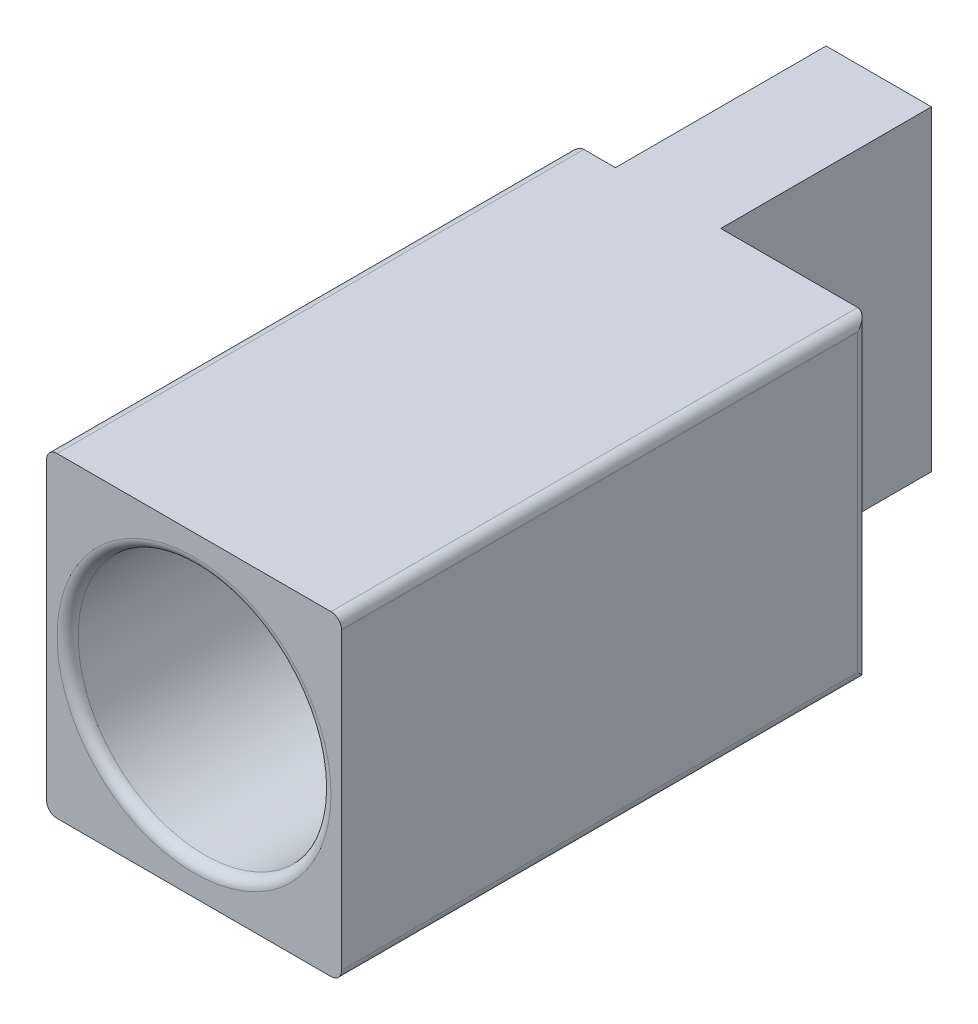
ISO-10303-21;
HEADER;
FILE_DESCRIPTION(('STEP AP214'),'2;1');
FILE_NAME('part.step','',(''),(''),'','','');
FILE_SCHEMA(('AUTOMOTIVE_DESIGN { 1 0 10303 214 1 1 1 1 }'));
ENDSEC;
DATA;
#1=APPLICATION_CONTEXT('core data for automotive mechanical design processes');
#2=APPLICATION_PROTOCOL_DEFINITION('international standard','automotive_design',2000,#1);
#3=PRODUCT_CONTEXT('',#1,'mechanical');
#4=PRODUCT('Part','Part','',(#3));
#5=PRODUCT_RELATED_PRODUCT_CATEGORY('part','',(#4));
#6=PRODUCT_DEFINITION_FORMATION('','',#4);
#7=PRODUCT_DEFINITION_CONTEXT('part definition',#1,'design');
#8=PRODUCT_DEFINITION('design','',#6,#7);
#9=PRODUCT_DEFINITION_SHAPE('','',#8);
#10=(LENGTH_UNIT() NAMED_UNIT(*) SI_UNIT(.MILLI.,.METRE.));
#11=(NAMED_UNIT(*) PLANE_ANGLE_UNIT() SI_UNIT($,.RADIAN.));
#12=(NAMED_UNIT(*) SI_UNIT($,.STERADIAN.) SOLID_ANGLE_UNIT());
#13=UNCERTAINTY_MEASURE_WITH_UNIT(LENGTH_MEASURE(1.E-05),#10,'distance_accuracy_value','');
#14=(GEOMETRIC_REPRESENTATION_CONTEXT(3) GLOBAL_UNCERTAINTY_ASSIGNED_CONTEXT((#13)) GLOBAL_UNIT_ASSIGNED_CONTEXT((#10,
#11,#12)) REPRESENTATION_CONTEXT('',''));
#15=CARTESIAN_POINT('',(0.,0.,0.));
#16=DIRECTION('',(0.,0.,1.));
#17=DIRECTION('',(1.,0.,0.));
#18=AXIS2_PLACEMENT_3D('',#15,#16,#17);
#19=CARTESIAN_POINT('',(2.,-7.5,5.));
#20=DIRECTION('',(-1.,0.,0.));
#21=DIRECTION('',(0.,0.,1.));
#22=AXIS2_PLACEMENT_3D('',#19,#20,#21);
#23=CYLINDRICAL_SURFACE('',#22,1.64999999999999);
#24=CARTESIAN_POINT('',(7.,-7.5,5.));
#25=DIRECTION('',(1.,0.,0.));
#26=DIRECTION('',(0.,0.,-1.));
#27=AXIS2_PLACEMENT_3D('',#24,#25,#26);
#28=CIRCLE('',#27,1.64999999999999);
#29=CARTESIAN_POINT('',(7.,-7.5,3.35000000000001));
#30=VERTEX_POINT('',#29);
#31=EDGE_CURVE('E173',#30,#30,#28,.T.);
#32=ORIENTED_EDGE('',*,*,#31,.T.);
#33=EDGE_LOOP('',(#32));
#34=FACE_BOUND('',#33,.T.);
#35=CARTESIAN_POINT('',(3.,-7.5,5.));
#36=DIRECTION('',(-1.,0.,0.));
#37=DIRECTION('',(0.,0.,1.));
#38=AXIS2_PLACEMENT_3D('',#35,#36,#37);
#39=CIRCLE('',#38,1.64999999999999);
#40=CARTESIAN_POINT('',(3.,-7.5,6.64999999999999));
#41=VERTEX_POINT('',#40);
#42=EDGE_CURVE('E169',#41,#41,#39,.F.);
#43=ORIENTED_EDGE('',*,*,#42,.F.);
#44=EDGE_LOOP('',(#43));
#45=FACE_BOUND('',#44,.T.);
#46=ADVANCED_FACE('F39',(#34,#45),#23,.F.);
#47=CARTESIAN_POINT('',(2.,0.000999999999999265,0.));
#48=DIRECTION('',(1.,0.,0.));
#49=DIRECTION('',(0.,0.,-1.));
#50=AXIS2_PLACEMENT_3D('',#47,#48,#49);
#51=PLANE('',#50);
#52=CARTESIAN_POINT('',(2.,-7.5,5.));
#53=DIRECTION('',(-1.,0.,0.));
#54=DIRECTION('',(0.,0.,1.));
#55=AXIS2_PLACEMENT_3D('',#52,#53,#54);
#56=CIRCLE('',#55,4.);
#57=CARTESIAN_POINT('',(2.,-7.5,9.));
#58=VERTEX_POINT('',#57);
#59=EDGE_CURVE('E242',#58,#58,#56,.T.);
#60=ORIENTED_EDGE('',*,*,#59,.F.);
#61=EDGE_LOOP('',(#60));
#62=FACE_BOUND('',#61,.T.);
#63=DIRECTION('',(0.,0.,-1.));
#64=VECTOR('',#63,1.);
#65=CARTESIAN_POINT('',(2.,0.,0.));
#66=LINE('',#65,#64);
#67=CARTESIAN_POINT('',(2.,0.,10.));
#68=VERTEX_POINT('',#67);
#69=CARTESIAN_POINT('',(2.,0.,0.));
#70=VERTEX_POINT('',#69);
#71=EDGE_CURVE('E137',#68,#70,#66,.T.);
#72=ORIENTED_EDGE('',*,*,#71,.T.);
#73=DIRECTION('',(0.,-1.,0.));
#74=VECTOR('',#73,1.);
#75=CARTESIAN_POINT('',(2.,0.000999999999999265,0.));
#76=LINE('',#75,#74);
#77=CARTESIAN_POINT('',(2.,-15.,0.));
#78=VERTEX_POINT('',#77);
#79=EDGE_CURVE('E132',#70,#78,#76,.T.);
#80=ORIENTED_EDGE('',*,*,#79,.T.);
#81=DIRECTION('',(0.,0.,1.));
#82=VECTOR('',#81,1.);
#83=CARTESIAN_POINT('',(2.,-15.,0.));
#84=LINE('',#83,#82);
#85=CARTESIAN_POINT('',(2.,-15.,10.));
#86=VERTEX_POINT('',#85);
#87=EDGE_CURVE('E135',#78,#86,#84,.T.);
#88=ORIENTED_EDGE('',*,*,#87,.T.);
#89=DIRECTION('',(0.,-1.,0.));
#90=VECTOR('',#89,1.);
#91=CARTESIAN_POINT('',(2.,0.000999999999999265,10.));
#92=LINE('',#91,#90);
#93=EDGE_CURVE('E143',#68,#86,#92,.T.);
#94=ORIENTED_EDGE('',*,*,#93,.F.);
#95=EDGE_LOOP('',(#72,#80,#88,#94));
#96=FACE_BOUND('',#95,.T.);
#97=ADVANCED_FACE('F134',(#62,#96),#51,.F.);
#98=CARTESIAN_POINT('',(0.,0.,35.));
#99=DIRECTION('',(1.,0.,0.));
#100=DIRECTION('',(0.,1.,0.));
#101=AXIS2_PLACEMENT_3D('',#98,#99,#100);
#102=PLANE('',#101);
#103=DIRECTION('',(0.,-1.,0.));
#104=VECTOR('',#103,1.);
#105=CARTESIAN_POINT('',(0.,0.,35.));
#106=LINE('',#105,#104);
#107=CARTESIAN_POINT('',(0.,-0.5,35.));
#108=VERTEX_POINT('',#107);
#109=CARTESIAN_POINT('',(0.,-14.5,35.));
#110=VERTEX_POINT('',#109);
#111=EDGE_CURVE('E162',#108,#110,#106,.T.);
#112=ORIENTED_EDGE('',*,*,#111,.F.);
#113=DIRECTION('',(0.,0.,-1.));
#114=VECTOR('',#113,1.);
#115=CARTESIAN_POINT('',(0.,-0.5,35.));
#116=LINE('',#115,#114);
#117=CARTESIAN_POINT('',(0.,-0.5,10.5));
#118=VERTEX_POINT('',#117);
#119=EDGE_CURVE('E181',#108,#118,#116,.T.);
#120=ORIENTED_EDGE('',*,*,#119,.T.);
#121=DIRECTION('',(0.,-1.,0.));
#122=VECTOR('',#121,1.);
#123=CARTESIAN_POINT('',(0.,-15.,10.5));
#124=LINE('',#123,#122);
#125=CARTESIAN_POINT('',(0.,-14.5,10.5));
#126=VERTEX_POINT('',#125);
#127=EDGE_CURVE('E175',#118,#126,#124,.T.);
#128=ORIENTED_EDGE('',*,*,#127,.T.);
#129=DIRECTION('',(0.,0.,-1.));
#130=VECTOR('',#129,1.);
#131=CARTESIAN_POINT('',(0.,-14.5,35.));
#132=LINE('',#131,#130);
#133=EDGE_CURVE('E178',#126,#110,#132,.F.);
#134=ORIENTED_EDGE('',*,*,#133,.T.);
#135=EDGE_LOOP('',(#112,#120,#128,#134));
#136=FACE_BOUND('',#135,.T.);
#137=ADVANCED_FACE('F322',(#136),#102,.F.);
#138=CARTESIAN_POINT('',(0.,-15.,35.));
#139=DIRECTION('',(0.,1.,0.));
#140=DIRECTION('',(0.,0.,1.));
#141=AXIS2_PLACEMENT_3D('',#138,#139,#140);
#142=PLANE('',#141);
#143=DIRECTION('',(1.,0.,0.));
#144=VECTOR('',#143,1.);
#145=CARTESIAN_POINT('',(0.,-15.,10.));
#146=LINE('',#145,#144);
#147=CARTESIAN_POINT('',(7.,-15.,10.));
#148=VERTEX_POINT('',#147);
#149=CARTESIAN_POINT('',(13.5,-15.,10.));
#150=VERTEX_POINT('',#149);
#151=EDGE_CURVE('E262',#148,#150,#146,.T.);
#152=ORIENTED_EDGE('',*,*,#151,.T.);
#153=DIRECTION('',(0.,0.,-1.));
#154=VECTOR('',#153,1.);
#155=CARTESIAN_POINT('',(13.5,-15.,35.));
#156=LINE('',#155,#154);
#157=CARTESIAN_POINT('',(13.5,-15.,35.));
#158=VERTEX_POINT('',#157);
#159=EDGE_CURVE('E219',#150,#158,#156,.F.);
#160=ORIENTED_EDGE('',*,*,#159,.T.);
#161=DIRECTION('',(1.,0.,0.));
#162=VECTOR('',#161,1.);
#163=CARTESIAN_POINT('',(0.,-15.,35.));
#164=LINE('',#163,#162);
#165=CARTESIAN_POINT('',(0.500000000000002,-15.,35.));
#166=VERTEX_POINT('',#165);
#167=EDGE_CURVE('E261',#166,#158,#164,.T.);
#168=ORIENTED_EDGE('',*,*,#167,.F.);
#169=DIRECTION('',(0.,0.,-1.));
#170=VECTOR('',#169,1.);
#171=CARTESIAN_POINT('',(0.500000000000002,-15.,35.));
#172=LINE('',#171,#170);
#173=CARTESIAN_POINT('',(0.500000000000002,-15.,10.));
#174=VERTEX_POINT('',#173);
#175=EDGE_CURVE('E64',#166,#174,#172,.T.);
#176=ORIENTED_EDGE('',*,*,#175,.T.);
#177=DIRECTION('',(1.,0.,0.));
#178=VECTOR('',#177,1.);
#179=CARTESIAN_POINT('',(0.,-15.,10.));
#180=LINE('',#179,#178);
#181=EDGE_CURVE('E144',#174,#86,#180,.T.);
#182=ORIENTED_EDGE('',*,*,#181,.T.);
#183=ORIENTED_EDGE('',*,*,#87,.F.);
#184=DIRECTION('',(1.,0.,0.));
#185=VECTOR('',#184,1.);
#186=CARTESIAN_POINT('',(0.,-15.,0.));
#187=LINE('',#186,#185);
#188=CARTESIAN_POINT('',(7.,-15.,0.));
#189=VERTEX_POINT('',#188);
#190=EDGE_CURVE('E149',#78,#189,#187,.T.);
#191=ORIENTED_EDGE('',*,*,#190,.T.);
#192=DIRECTION('',(0.,0.,1.));
#193=VECTOR('',#192,1.);
#194=CARTESIAN_POINT('',(7.,-15.,0.));
#195=LINE('',#194,#193);
#196=EDGE_CURVE('E284',#189,#148,#195,.T.);
#197=ORIENTED_EDGE('',*,*,#196,.T.);
#198=EDGE_LOOP('',(#152,#160,#168,#176,#182,#183,#191,#197));
#199=FACE_BOUND('',#198,.T.);
#200=ADVANCED_FACE('F147',(#199),#142,.F.);
#201=CARTESIAN_POINT('',(14.,0.,35.));
#202=DIRECTION('',(-1.,0.,0.));
#203=DIRECTION('',(0.,-1.,0.));
#204=AXIS2_PLACEMENT_3D('',#201,#202,#203);
#205=PLANE('',#204);
#206=DIRECTION('',(0.,-1.,0.));
#207=VECTOR('',#206,1.);
#208=CARTESIAN_POINT('',(14.,0.,10.5));
#209=LINE('',#208,#207);
#210=CARTESIAN_POINT('',(14.,-14.5,10.5));
#211=VERTEX_POINT('',#210);
#212=CARTESIAN_POINT('',(14.,-0.5,10.5));
#213=VERTEX_POINT('',#212);
#214=EDGE_CURVE('E208',#211,#213,#209,.F.);
#215=ORIENTED_EDGE('',*,*,#214,.T.);
#216=DIRECTION('',(0.,0.,-1.));
#217=VECTOR('',#216,1.);
#218=CARTESIAN_POINT('',(14.,-0.5,35.));
#219=LINE('',#218,#217);
#220=CARTESIAN_POINT('',(14.,-0.5,35.));
#221=VERTEX_POINT('',#220);
#222=EDGE_CURVE('E214',#213,#221,#219,.F.);
#223=ORIENTED_EDGE('',*,*,#222,.T.);
#224=DIRECTION('',(0.,1.,0.));
#225=VECTOR('',#224,1.);
#226=CARTESIAN_POINT('',(14.,0.,35.));
#227=LINE('',#226,#225);
#228=CARTESIAN_POINT('',(14.,-14.5,35.));
#229=VERTEX_POINT('',#228);
#230=EDGE_CURVE('E271',#229,#221,#227,.T.);
#231=ORIENTED_EDGE('',*,*,#230,.F.);
#232=DIRECTION('',(0.,0.,-1.));
#233=VECTOR('',#232,1.);
#234=CARTESIAN_POINT('',(14.,-14.5,35.));
#235=LINE('',#234,#233);
#236=EDGE_CURVE('E211',#229,#211,#235,.T.);
#237=ORIENTED_EDGE('',*,*,#236,.T.);
#238=EDGE_LOOP('',(#215,#223,#231,#237));
#239=FACE_BOUND('',#238,.T.);
#240=ADVANCED_FACE('F358',(#239),#205,.F.);
#241=CARTESIAN_POINT('',(0.,0.,35.));
#242=DIRECTION('',(0.,-1.,0.));
#243=DIRECTION('',(0.,0.,-1.));
#244=AXIS2_PLACEMENT_3D('',#241,#242,#243);
#245=PLANE('',#244);
#246=DIRECTION('',(-1.,0.,0.));
#247=VECTOR('',#246,1.);
#248=CARTESIAN_POINT('',(0.,0.,10.));
#249=LINE('',#248,#247);
#250=CARTESIAN_POINT('',(0.5,0.,10.));
#251=VERTEX_POINT('',#250);
#252=EDGE_CURVE('E152',#68,#251,#249,.T.);
#253=ORIENTED_EDGE('',*,*,#252,.T.);
#254=DIRECTION('',(0.,0.,-1.));
#255=VECTOR('',#254,1.);
#256=CARTESIAN_POINT('',(0.5,0.,35.));
#257=LINE('',#256,#255);
#258=CARTESIAN_POINT('',(0.5,0.,35.));
#259=VERTEX_POINT('',#258);
#260=EDGE_CURVE('E189',#251,#259,#257,.F.);
#261=ORIENTED_EDGE('',*,*,#260,.T.);
#262=DIRECTION('',(-1.,0.,0.));
#263=VECTOR('',#262,1.);
#264=CARTESIAN_POINT('',(0.,0.,35.));
#265=LINE('',#264,#263);
#266=CARTESIAN_POINT('',(13.5,0.,35.));
#267=VERTEX_POINT('',#266);
#268=EDGE_CURVE('E166',#267,#259,#265,.T.);
#269=ORIENTED_EDGE('',*,*,#268,.F.);
#270=DIRECTION('',(0.,0.,-1.));
#271=VECTOR('',#270,1.);
#272=CARTESIAN_POINT('',(13.5,0.,35.));
#273=LINE('',#272,#271);
#274=CARTESIAN_POINT('',(13.5,0.,10.));
#275=VERTEX_POINT('',#274);
#276=EDGE_CURVE('E185',#267,#275,#273,.T.);
#277=ORIENTED_EDGE('',*,*,#276,.T.);
#278=DIRECTION('',(-1.,0.,0.));
#279=VECTOR('',#278,1.);
#280=CARTESIAN_POINT('',(0.,0.,10.));
#281=LINE('',#280,#279);
#282=CARTESIAN_POINT('',(7.,0.,10.));
#283=VERTEX_POINT('',#282);
#284=EDGE_CURVE('E291',#275,#283,#281,.T.);
#285=ORIENTED_EDGE('',*,*,#284,.T.);
#286=DIRECTION('',(0.,0.,-1.));
#287=VECTOR('',#286,1.);
#288=CARTESIAN_POINT('',(7.,0.,0.));
#289=LINE('',#288,#287);
#290=CARTESIAN_POINT('',(7.,0.,0.));
#291=VERTEX_POINT('',#290);
#292=EDGE_CURVE('E277',#283,#291,#289,.T.);
#293=ORIENTED_EDGE('',*,*,#292,.T.);
#294=DIRECTION('',(-1.,0.,0.));
#295=VECTOR('',#294,1.);
#296=CARTESIAN_POINT('',(0.,0.,0.));
#297=LINE('',#296,#295);
#298=EDGE_CURVE('E158',#291,#70,#297,.T.);
#299=ORIENTED_EDGE('',*,*,#298,.T.);
#300=ORIENTED_EDGE('',*,*,#71,.F.);
#301=EDGE_LOOP('',(#253,#261,#269,#277,#285,#293,#299,#300));
#302=FACE_BOUND('',#301,.T.);
#303=ADVANCED_FACE('F355',(#302),#245,.F.);
#304=CARTESIAN_POINT('',(0.,0.,0.));
#305=DIRECTION('',(0.,0.,1.));
#306=DIRECTION('',(1.,0.,0.));
#307=AXIS2_PLACEMENT_3D('',#304,#305,#306);
#308=PLANE('',#307);
#309=ORIENTED_EDGE('',*,*,#190,.F.);
#310=ORIENTED_EDGE('',*,*,#79,.F.);
#311=ORIENTED_EDGE('',*,*,#298,.F.);
#312=DIRECTION('',(0.,-1.,0.));
#313=VECTOR('',#312,1.);
#314=CARTESIAN_POINT('',(7.,0.000999999999999265,0.));
#315=LINE('',#314,#313);
#316=EDGE_CURVE('E156',#291,#189,#315,.T.);
#317=ORIENTED_EDGE('',*,*,#316,.T.);
#318=EDGE_LOOP('',(#309,#310,#311,#317));
#319=FACE_BOUND('',#318,.T.);
#320=ADVANCED_FACE('F155',(#319),#308,.F.);
#321=CARTESIAN_POINT('',(0.,0.,35.));
#322=DIRECTION('',(0.,0.,1.));
#323=DIRECTION('',(1.,0.,0.));
#324=AXIS2_PLACEMENT_3D('',#321,#322,#323);
#325=PLANE('',#324);
#326=CARTESIAN_POINT('',(7.,-7.5,35.));
#327=DIRECTION('',(0.,0.,1.));
#328=DIRECTION('',(1.,0.,0.));
#329=AXIS2_PLACEMENT_3D('',#326,#327,#328);
#330=CIRCLE('',#329,6.5);
#331=CARTESIAN_POINT('',(13.5,-7.5,35.));
#332=VERTEX_POINT('',#331);
#333=EDGE_CURVE('E192',#332,#332,#330,.F.);
#334=ORIENTED_EDGE('',*,*,#333,.T.);
#335=EDGE_LOOP('',(#334));
#336=FACE_BOUND('',#335,.T.);
#337=ORIENTED_EDGE('',*,*,#268,.T.);
#338=CARTESIAN_POINT('',(0.5,-0.5,35.));
#339=DIRECTION('',(0.,0.,1.));
#340=DIRECTION('',(1.,0.,0.));
#341=AXIS2_PLACEMENT_3D('',#338,#339,#340);
#342=CIRCLE('',#341,0.5);
#343=EDGE_CURVE('E205',#259,#108,#342,.T.);
#344=ORIENTED_EDGE('',*,*,#343,.T.);
#345=ORIENTED_EDGE('',*,*,#111,.T.);
#346=CARTESIAN_POINT('',(0.500000000000002,-14.5,35.));
#347=DIRECTION('',(0.,0.,1.));
#348=DIRECTION('',(1.,0.,0.));
#349=AXIS2_PLACEMENT_3D('',#346,#347,#348);
#350=CIRCLE('',#349,0.5);
#351=EDGE_CURVE('E196',#110,#166,#350,.T.);
#352=ORIENTED_EDGE('',*,*,#351,.T.);
#353=ORIENTED_EDGE('',*,*,#167,.T.);
#354=CARTESIAN_POINT('',(13.5,-14.5,35.));
#355=DIRECTION('',(0.,0.,1.));
#356=DIRECTION('',(1.,0.,0.));
#357=AXIS2_PLACEMENT_3D('',#354,#355,#356);
#358=CIRCLE('',#357,0.5);
#359=EDGE_CURVE('E199',#158,#229,#358,.T.);
#360=ORIENTED_EDGE('',*,*,#359,.T.);
#361=ORIENTED_EDGE('',*,*,#230,.T.);
#362=CARTESIAN_POINT('',(13.5,-0.5,35.));
#363=DIRECTION('',(0.,0.,1.));
#364=DIRECTION('',(1.,0.,0.));
#365=AXIS2_PLACEMENT_3D('',#362,#363,#364);
#366=CIRCLE('',#365,0.5);
#367=EDGE_CURVE('E202',#221,#267,#366,.T.);
#368=ORIENTED_EDGE('',*,*,#367,.T.);
#369=EDGE_LOOP('',(#337,#344,#345,#352,#353,#360,#361,#368));
#370=FACE_BOUND('',#369,.T.);
#371=ADVANCED_FACE('F265',(#336,#370),#325,.T.);
#372=CARTESIAN_POINT('',(7.,-7.5,20.));
#373=DIRECTION('',(0.,0.,1.));
#374=DIRECTION('',(1.,0.,0.));
#375=AXIS2_PLACEMENT_3D('',#372,#373,#374);
#376=CYLINDRICAL_SURFACE('',#375,6.);
#377=CARTESIAN_POINT('',(7.,-7.5,20.5));
#378=DIRECTION('',(0.,0.,1.));
#379=DIRECTION('',(1.,0.,0.));
#380=AXIS2_PLACEMENT_3D('',#377,#378,#379);
#381=CIRCLE('',#380,6.);
#382=CARTESIAN_POINT('',(13.,-7.5,20.5));
#383=VERTEX_POINT('',#382);
#384=EDGE_CURVE('E230',#383,#383,#381,.F.);
#385=ORIENTED_EDGE('',*,*,#384,.T.);
#386=EDGE_LOOP('',(#385));
#387=FACE_BOUND('',#386,.T.);
#388=CARTESIAN_POINT('',(7.,-7.5,34.5));
#389=DIRECTION('',(0.,0.,1.));
#390=DIRECTION('',(1.,0.,0.));
#391=AXIS2_PLACEMENT_3D('',#388,#389,#390);
#392=CIRCLE('',#391,6.);
#393=CARTESIAN_POINT('',(13.,-7.5,34.5));
#394=VERTEX_POINT('',#393);
#395=EDGE_CURVE('E226',#394,#394,#392,.T.);
#396=ORIENTED_EDGE('',*,*,#395,.T.);
#397=EDGE_LOOP('',(#396));
#398=FACE_BOUND('',#397,.T.);
#399=ADVANCED_FACE('F345',(#387,#398),#376,.F.);
#400=CARTESIAN_POINT('',(7.,-7.5,20.));
#401=DIRECTION('',(0.,0.,1.));
#402=DIRECTION('',(1.,0.,0.));
#403=AXIS2_PLACEMENT_3D('',#400,#401,#402);
#404=PLANE('',#403);
#405=CARTESIAN_POINT('',(7.,-7.5,20.));
#406=DIRECTION('',(0.,0.,1.));
#407=DIRECTION('',(1.,0.,0.));
#408=AXIS2_PLACEMENT_3D('',#405,#406,#407);
#409=CIRCLE('',#408,5.5);
#410=CARTESIAN_POINT('',(12.5,-7.5,20.));
#411=VERTEX_POINT('',#410);
#412=EDGE_CURVE('E222',#411,#411,#409,.T.);
#413=ORIENTED_EDGE('',*,*,#412,.T.);
#414=EDGE_LOOP('',(#413));
#415=FACE_BOUND('',#414,.T.);
#416=ADVANCED_FACE('F342',(#415),#404,.T.);
#417=CARTESIAN_POINT('',(0.,0.000999999999999265,10.));
#418=DIRECTION('',(0.,0.,-1.));
#419=DIRECTION('',(-1.,0.,0.));
#420=AXIS2_PLACEMENT_3D('',#417,#418,#419);
#421=PLANE('',#420);
#422=ORIENTED_EDGE('',*,*,#284,.F.);
#423=DIRECTION('',(0.,-1.,0.));
#424=VECTOR('',#423,1.);
#425=CARTESIAN_POINT('',(13.5,-15.,10.));
#426=LINE('',#425,#424);
#427=EDGE_CURVE('E49',#275,#150,#426,.T.);
#428=ORIENTED_EDGE('',*,*,#427,.T.);
#429=ORIENTED_EDGE('',*,*,#151,.F.);
#430=DIRECTION('',(0.,-1.,0.));
#431=VECTOR('',#430,1.);
#432=CARTESIAN_POINT('',(7.,0.000999999999999265,10.));
#433=LINE('',#432,#431);
#434=EDGE_CURVE('E281',#283,#148,#433,.T.);
#435=ORIENTED_EDGE('',*,*,#434,.F.);
#436=EDGE_LOOP('',(#422,#428,#429,#435));
#437=FACE_BOUND('',#436,.T.);
#438=ADVANCED_FACE('F338',(#437),#421,.T.);
#439=CARTESIAN_POINT('',(7.,0.000999999999999265,0.));
#440=DIRECTION('',(1.,0.,0.));
#441=DIRECTION('',(0.,0.,-1.));
#442=AXIS2_PLACEMENT_3D('',#439,#440,#441);
#443=PLANE('',#442);
#444=ORIENTED_EDGE('',*,*,#31,.F.);
#445=EDGE_LOOP('',(#444));
#446=FACE_BOUND('',#445,.T.);
#447=ORIENTED_EDGE('',*,*,#434,.T.);
#448=ORIENTED_EDGE('',*,*,#196,.F.);
#449=ORIENTED_EDGE('',*,*,#316,.F.);
#450=ORIENTED_EDGE('',*,*,#292,.F.);
#451=EDGE_LOOP('',(#447,#448,#449,#450));
#452=FACE_BOUND('',#451,.T.);
#453=ADVANCED_FACE('F335',(#446,#452),#443,.T.);
#454=CARTESIAN_POINT('',(0.,0.000999999999999265,10.));
#455=DIRECTION('',(0.,0.,-1.));
#456=DIRECTION('',(-1.,0.,0.));
#457=AXIS2_PLACEMENT_3D('',#454,#455,#456);
#458=PLANE('',#457);
#459=ORIENTED_EDGE('',*,*,#181,.F.);
#460=DIRECTION('',(0.,-1.,0.));
#461=VECTOR('',#460,1.);
#462=CARTESIAN_POINT('',(0.5,0.,10.));
#463=LINE('',#462,#461);
#464=EDGE_CURVE('E11',#174,#251,#463,.F.);
#465=ORIENTED_EDGE('',*,*,#464,.T.);
#466=ORIENTED_EDGE('',*,*,#252,.F.);
#467=ORIENTED_EDGE('',*,*,#93,.T.);
#468=EDGE_LOOP('',(#459,#465,#466,#467));
#469=FACE_BOUND('',#468,.T.);
#470=ADVANCED_FACE('F334',(#469),#458,.T.);
#471=CARTESIAN_POINT('',(3.,-7.5,5.));
#472=DIRECTION('',(-1.,0.,0.));
#473=DIRECTION('',(0.,0.,1.));
#474=AXIS2_PLACEMENT_3D('',#471,#472,#473);
#475=PLANE('',#474);
#476=CARTESIAN_POINT('',(3.,-7.5,5.));
#477=DIRECTION('',(-1.,0.,0.));
#478=DIRECTION('',(0.,0.,1.));
#479=AXIS2_PLACEMENT_3D('',#476,#477,#478);
#480=CIRCLE('',#479,4.);
#481=CARTESIAN_POINT('',(3.,-7.5,9.));
#482=VERTEX_POINT('',#481);
#483=EDGE_CURVE('E174',#482,#482,#480,.T.);
#484=ORIENTED_EDGE('',*,*,#483,.T.);
#485=EDGE_LOOP('',(#484));
#486=FACE_BOUND('',#485,.T.);
#487=ORIENTED_EDGE('',*,*,#42,.T.);
#488=EDGE_LOOP('',(#487));
#489=FACE_BOUND('',#488,.T.);
#490=ADVANCED_FACE('F311',(#486,#489),#475,.T.);
#491=CARTESIAN_POINT('',(3.,-7.5,5.));
#492=DIRECTION('',(-1.,0.,0.));
#493=DIRECTION('',(0.,0.,1.));
#494=AXIS2_PLACEMENT_3D('',#491,#492,#493);
#495=CYLINDRICAL_SURFACE('',#494,4.);
#496=ORIENTED_EDGE('',*,*,#483,.F.);
#497=EDGE_LOOP('',(#496));
#498=FACE_BOUND('',#497,.T.);
#499=ORIENTED_EDGE('',*,*,#59,.T.);
#500=EDGE_LOOP('',(#499));
#501=FACE_BOUND('',#500,.T.);
#502=ADVANCED_FACE('F314',(#498,#501),#495,.F.);
#503=CARTESIAN_POINT('',(0.500000000000002,-14.5,35.));
#504=DIRECTION('',(0.,0.,-1.));
#505=DIRECTION('',(-1.,0.,0.));
#506=AXIS2_PLACEMENT_3D('',#503,#504,#505);
#507=CYLINDRICAL_SURFACE('',#506,0.5);
#508=ORIENTED_EDGE('',*,*,#351,.F.);
#509=ORIENTED_EDGE('',*,*,#133,.F.);
#510=CARTESIAN_POINT('',(0.500000000000002,-14.5,10.5));
#511=DIRECTION('',(0.,0.707106781186547,-0.707106781186547));
#512=DIRECTION('',(0.,0.707106781186547,0.707106781186547));
#513=AXIS2_PLACEMENT_3D('',#510,#511,#512);
#514=ELLIPSE('',#513,0.707106781186547,0.5);
#515=EDGE_CURVE('E239',#174,#126,#514,.T.);
#516=ORIENTED_EDGE('',*,*,#515,.F.);
#517=ORIENTED_EDGE('',*,*,#175,.F.);
#518=EDGE_LOOP('',(#508,#509,#516,#517));
#519=FACE_BOUND('',#518,.T.);
#520=ADVANCED_FACE('F317',(#519),#507,.T.);
#521=CARTESIAN_POINT('',(0.5,0.,10.5));
#522=DIRECTION('',(0.,1.,0.));
#523=DIRECTION('',(-1.,0.,0.));
#524=AXIS2_PLACEMENT_3D('',#521,#522,#523);
#525=CYLINDRICAL_SURFACE('',#524,0.5);
#526=ORIENTED_EDGE('',*,*,#515,.T.);
#527=ORIENTED_EDGE('',*,*,#127,.F.);
#528=CARTESIAN_POINT('',(0.5,-0.5,10.5));
#529=DIRECTION('',(0.,0.707106781186547,0.707106781186547));
#530=DIRECTION('',(0.,0.707106781186547,-0.707106781186547));
#531=AXIS2_PLACEMENT_3D('',#528,#529,#530);
#532=ELLIPSE('',#531,0.707106781186547,0.5);
#533=EDGE_CURVE('E236',#251,#118,#532,.T.);
#534=ORIENTED_EDGE('',*,*,#533,.F.);
#535=ORIENTED_EDGE('',*,*,#464,.F.);
#536=EDGE_LOOP('',(#526,#527,#534,#535));
#537=FACE_BOUND('',#536,.T.);
#538=ADVANCED_FACE('F368',(#537),#525,.T.);
#539=CARTESIAN_POINT('',(0.5,-0.5,35.));
#540=DIRECTION('',(0.,0.,-1.));
#541=DIRECTION('',(-1.,0.,0.));
#542=AXIS2_PLACEMENT_3D('',#539,#540,#541);
#543=CYLINDRICAL_SURFACE('',#542,0.5);
#544=ORIENTED_EDGE('',*,*,#343,.F.);
#545=ORIENTED_EDGE('',*,*,#260,.F.);
#546=ORIENTED_EDGE('',*,*,#533,.T.);
#547=ORIENTED_EDGE('',*,*,#119,.F.);
#548=EDGE_LOOP('',(#544,#545,#546,#547));
#549=FACE_BOUND('',#548,.T.);
#550=ADVANCED_FACE('F365',(#549),#543,.T.);
#551=CARTESIAN_POINT('',(13.5,-14.5,35.));
#552=DIRECTION('',(0.,0.,-1.));
#553=DIRECTION('',(-1.,0.,0.));
#554=AXIS2_PLACEMENT_3D('',#551,#552,#553);
#555=CYLINDRICAL_SURFACE('',#554,0.5);
#556=ORIENTED_EDGE('',*,*,#359,.F.);
#557=ORIENTED_EDGE('',*,*,#159,.F.);
#558=CARTESIAN_POINT('',(13.5,-14.5,10.5));
#559=DIRECTION('',(0.,0.707106781186547,-0.707106781186547));
#560=DIRECTION('',(0.,0.707106781186547,0.707106781186547));
#561=AXIS2_PLACEMENT_3D('',#558,#559,#560);
#562=ELLIPSE('',#561,0.707106781186547,0.5);
#563=EDGE_CURVE('E43',#211,#150,#562,.T.);
#564=ORIENTED_EDGE('',*,*,#563,.F.);
#565=ORIENTED_EDGE('',*,*,#236,.F.);
#566=EDGE_LOOP('',(#556,#557,#564,#565));
#567=FACE_BOUND('',#566,.T.);
#568=ADVANCED_FACE('F259',(#567),#555,.T.);
#569=CARTESIAN_POINT('',(13.5,0.00100000000000083,10.5));
#570=DIRECTION('',(0.,1.,0.));
#571=DIRECTION('',(-1.,0.,0.));
#572=AXIS2_PLACEMENT_3D('',#569,#570,#571);
#573=CYLINDRICAL_SURFACE('',#572,0.5);
#574=ORIENTED_EDGE('',*,*,#563,.T.);
#575=ORIENTED_EDGE('',*,*,#427,.F.);
#576=CARTESIAN_POINT('',(13.5,-0.5,10.5));
#577=DIRECTION('',(0.,0.707106781186547,0.707106781186547));
#578=DIRECTION('',(0.,0.707106781186547,-0.707106781186547));
#579=AXIS2_PLACEMENT_3D('',#576,#577,#578);
#580=ELLIPSE('',#579,0.707106781186547,0.5);
#581=EDGE_CURVE('E243',#213,#275,#580,.T.);
#582=ORIENTED_EDGE('',*,*,#581,.F.);
#583=ORIENTED_EDGE('',*,*,#214,.F.);
#584=EDGE_LOOP('',(#574,#575,#582,#583));
#585=FACE_BOUND('',#584,.T.);
#586=ADVANCED_FACE('F254',(#585),#573,.T.);
#587=CARTESIAN_POINT('',(13.5,-0.5,35.));
#588=DIRECTION('',(0.,0.,-1.));
#589=DIRECTION('',(-1.,0.,0.));
#590=AXIS2_PLACEMENT_3D('',#587,#588,#589);
#591=CYLINDRICAL_SURFACE('',#590,0.5);
#592=ORIENTED_EDGE('',*,*,#367,.F.);
#593=ORIENTED_EDGE('',*,*,#222,.F.);
#594=ORIENTED_EDGE('',*,*,#581,.T.);
#595=ORIENTED_EDGE('',*,*,#276,.F.);
#596=EDGE_LOOP('',(#592,#593,#594,#595));
#597=FACE_BOUND('',#596,.T.);
#598=ADVANCED_FACE('F376',(#597),#591,.T.);
#599=CARTESIAN_POINT('',(7.,-7.5,20.5));
#600=DIRECTION('',(0.,0.,1.));
#601=DIRECTION('',(1.,0.,0.));
#602=AXIS2_PLACEMENT_3D('',#599,#600,#601);
#603=TOROIDAL_SURFACE('',#602,5.5,0.5);
#604=ORIENTED_EDGE('',*,*,#384,.F.);
#605=EDGE_LOOP('',(#604));
#606=FACE_BOUND('',#605,.T.);
#607=ORIENTED_EDGE('',*,*,#412,.F.);
#608=EDGE_LOOP('',(#607));
#609=FACE_BOUND('',#608,.T.);
#610=ADVANCED_FACE('F379',(#606,#609),#603,.F.);
#611=CARTESIAN_POINT('',(7.,-7.5,34.5));
#612=DIRECTION('',(0.,0.,1.));
#613=DIRECTION('',(1.,0.,0.));
#614=AXIS2_PLACEMENT_3D('',#611,#612,#613);
#615=TOROIDAL_SURFACE('',#614,6.5,0.5);
#616=ORIENTED_EDGE('',*,*,#333,.F.);
#617=EDGE_LOOP('',(#616));
#618=FACE_BOUND('',#617,.T.);
#619=ORIENTED_EDGE('',*,*,#395,.F.);
#620=EDGE_LOOP('',(#619));
#621=FACE_BOUND('',#620,.T.);
#622=ADVANCED_FACE('F41',(#618,#621),#615,.T.);
#623=CLOSED_SHELL('',(#46,#97,#137,#200,#240,#303,#320,#371,#399,#416,#438,#453,#470,#490,#502,
#520,#538,#550,#568,#586,#598,#610,#622));
#624=MANIFOLD_SOLID_BREP('B2',#623);
#625=ADVANCED_BREP_SHAPE_REPRESENTATION('',(#18,#624),#14);
#626=SHAPE_DEFINITION_REPRESENTATION(#9,#625);
ENDSEC;
END-ISO-10303-21;
